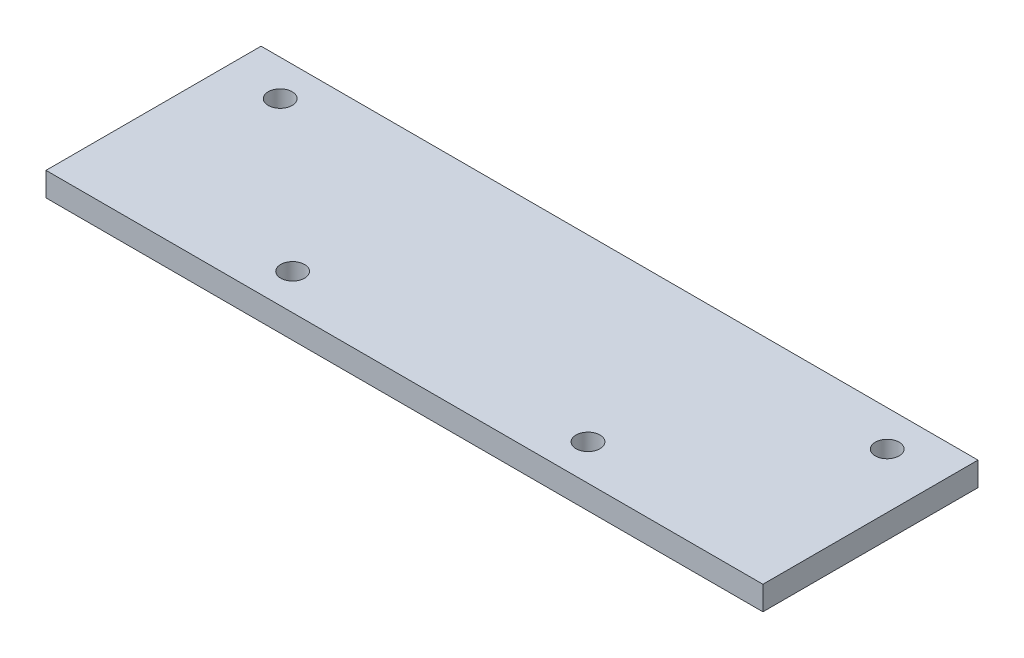
ISO-10303-21;
HEADER;
FILE_DESCRIPTION(('STEP AP214'),'2;1');
FILE_NAME('part.step','',(''),(''),'','','');
FILE_SCHEMA(('AUTOMOTIVE_DESIGN { 1 0 10303 214 1 1 1 1 }'));
ENDSEC;
DATA;
#1=APPLICATION_CONTEXT('core data for automotive mechanical design processes');
#2=APPLICATION_PROTOCOL_DEFINITION('international standard','automotive_design',2000,#1);
#3=PRODUCT_CONTEXT('',#1,'mechanical');
#4=PRODUCT('Part','Part','',(#3));
#5=PRODUCT_RELATED_PRODUCT_CATEGORY('part','',(#4));
#6=PRODUCT_DEFINITION_FORMATION('','',#4);
#7=PRODUCT_DEFINITION_CONTEXT('part definition',#1,'design');
#8=PRODUCT_DEFINITION('design','',#6,#7);
#9=PRODUCT_DEFINITION_SHAPE('','',#8);
#10=(LENGTH_UNIT() NAMED_UNIT(*) SI_UNIT(.MILLI.,.METRE.));
#11=(NAMED_UNIT(*) PLANE_ANGLE_UNIT() SI_UNIT($,.RADIAN.));
#12=(NAMED_UNIT(*) SI_UNIT($,.STERADIAN.) SOLID_ANGLE_UNIT());
#13=UNCERTAINTY_MEASURE_WITH_UNIT(LENGTH_MEASURE(1.E-05),#10,'distance_accuracy_value','');
#14=(GEOMETRIC_REPRESENTATION_CONTEXT(3) GLOBAL_UNCERTAINTY_ASSIGNED_CONTEXT((#13)) GLOBAL_UNIT_ASSIGNED_CONTEXT((#10,
#11,#12)) REPRESENTATION_CONTEXT('',''));
#15=CARTESIAN_POINT('',(0.,0.,0.));
#16=DIRECTION('',(0.,0.,1.));
#17=DIRECTION('',(1.,0.,0.));
#18=AXIS2_PLACEMENT_3D('',#15,#16,#17);
#19=CARTESIAN_POINT('',(95.25,6.35,-28.575));
#20=DIRECTION('',(-1.,0.,0.));
#21=DIRECTION('',(0.,0.,1.));
#22=AXIS2_PLACEMENT_3D('',#19,#20,#21);
#23=PLANE('',#22);
#24=DIRECTION('',(0.,0.,-1.));
#25=VECTOR('',#24,1.);
#26=CARTESIAN_POINT('',(95.25,0.,-28.575));
#27=LINE('',#26,#25);
#28=CARTESIAN_POINT('',(95.25,0.,28.575));
#29=VERTEX_POINT('',#28);
#30=CARTESIAN_POINT('',(95.25,0.,-28.575));
#31=VERTEX_POINT('',#30);
#32=EDGE_CURVE('E98',#29,#31,#27,.T.);
#33=ORIENTED_EDGE('',*,*,#32,.T.);
#34=DIRECTION('',(0.,-1.,0.));
#35=VECTOR('',#34,1.);
#36=CARTESIAN_POINT('',(95.25,6.35,-28.575));
#37=LINE('',#36,#35);
#38=CARTESIAN_POINT('',(95.25,6.35,-28.575));
#39=VERTEX_POINT('',#38);
#40=EDGE_CURVE('E11',#39,#31,#37,.T.);
#41=ORIENTED_EDGE('',*,*,#40,.F.);
#42=DIRECTION('',(0.,0.,-1.));
#43=VECTOR('',#42,1.);
#44=CARTESIAN_POINT('',(95.25,6.35,-28.575));
#45=LINE('',#44,#43);
#46=CARTESIAN_POINT('',(95.25,6.35,28.575));
#47=VERTEX_POINT('',#46);
#48=EDGE_CURVE('E86',#47,#39,#45,.T.);
#49=ORIENTED_EDGE('',*,*,#48,.F.);
#50=DIRECTION('',(0.,-1.,0.));
#51=VECTOR('',#50,1.);
#52=CARTESIAN_POINT('',(95.25,6.35,28.575));
#53=LINE('',#52,#51);
#54=EDGE_CURVE('E94',#47,#29,#53,.T.);
#55=ORIENTED_EDGE('',*,*,#54,.T.);
#56=EDGE_LOOP('',(#33,#41,#49,#55));
#57=FACE_BOUND('',#56,.T.);
#58=ADVANCED_FACE('F35',(#57),#23,.F.);
#59=CARTESIAN_POINT('',(-95.25,6.35,-28.575));
#60=DIRECTION('',(0.,0.,1.));
#61=DIRECTION('',(1.,0.,0.));
#62=AXIS2_PLACEMENT_3D('',#59,#60,#61);
#63=PLANE('',#62);
#64=DIRECTION('',(-1.,0.,0.));
#65=VECTOR('',#64,1.);
#66=CARTESIAN_POINT('',(-95.25,0.,-28.575));
#67=LINE('',#66,#65);
#68=CARTESIAN_POINT('',(-95.25,0.,-28.575));
#69=VERTEX_POINT('',#68);
#70=EDGE_CURVE('E90',#31,#69,#67,.T.);
#71=ORIENTED_EDGE('',*,*,#70,.T.);
#72=DIRECTION('',(0.,-1.,0.));
#73=VECTOR('',#72,1.);
#74=CARTESIAN_POINT('',(-95.25,6.35,-28.575));
#75=LINE('',#74,#73);
#76=CARTESIAN_POINT('',(-95.25,6.35,-28.575));
#77=VERTEX_POINT('',#76);
#78=EDGE_CURVE('E43',#77,#69,#75,.T.);
#79=ORIENTED_EDGE('',*,*,#78,.F.);
#80=DIRECTION('',(-1.,0.,0.));
#81=VECTOR('',#80,1.);
#82=CARTESIAN_POINT('',(-95.25,6.35,-28.575));
#83=LINE('',#82,#81);
#84=EDGE_CURVE('E81',#39,#77,#83,.T.);
#85=ORIENTED_EDGE('',*,*,#84,.F.);
#86=ORIENTED_EDGE('',*,*,#40,.T.);
#87=EDGE_LOOP('',(#71,#79,#85,#86));
#88=FACE_BOUND('',#87,.T.);
#89=ADVANCED_FACE('F89',(#88),#63,.F.);
#90=CARTESIAN_POINT('',(-95.25,6.35,-28.575));
#91=DIRECTION('',(1.,0.,0.));
#92=DIRECTION('',(0.,0.,-1.));
#93=AXIS2_PLACEMENT_3D('',#90,#91,#92);
#94=PLANE('',#93);
#95=DIRECTION('',(0.,0.,1.));
#96=VECTOR('',#95,1.);
#97=CARTESIAN_POINT('',(-95.25,0.,-28.575));
#98=LINE('',#97,#96);
#99=CARTESIAN_POINT('',(-95.25,0.,28.575));
#100=VERTEX_POINT('',#99);
#101=EDGE_CURVE('E68',#69,#100,#98,.T.);
#102=ORIENTED_EDGE('',*,*,#101,.T.);
#103=DIRECTION('',(0.,-1.,0.));
#104=VECTOR('',#103,1.);
#105=CARTESIAN_POINT('',(-95.25,6.35,28.575));
#106=LINE('',#105,#104);
#107=CARTESIAN_POINT('',(-95.25,6.35,28.575));
#108=VERTEX_POINT('',#107);
#109=EDGE_CURVE('E91',#108,#100,#106,.T.);
#110=ORIENTED_EDGE('',*,*,#109,.F.);
#111=DIRECTION('',(0.,0.,1.));
#112=VECTOR('',#111,1.);
#113=CARTESIAN_POINT('',(-95.25,6.35,-28.575));
#114=LINE('',#113,#112);
#115=EDGE_CURVE('E84',#77,#108,#114,.T.);
#116=ORIENTED_EDGE('',*,*,#115,.F.);
#117=ORIENTED_EDGE('',*,*,#78,.T.);
#118=EDGE_LOOP('',(#102,#110,#116,#117));
#119=FACE_BOUND('',#118,.T.);
#120=ADVANCED_FACE('F92',(#119),#94,.F.);
#121=CARTESIAN_POINT('',(-95.25,6.35,28.575));
#122=DIRECTION('',(0.,0.,-1.));
#123=DIRECTION('',(-1.,0.,0.));
#124=AXIS2_PLACEMENT_3D('',#121,#122,#123);
#125=PLANE('',#124);
#126=DIRECTION('',(1.,0.,0.));
#127=VECTOR('',#126,1.);
#128=CARTESIAN_POINT('',(-95.25,0.,28.575));
#129=LINE('',#128,#127);
#130=EDGE_CURVE('E74',#100,#29,#129,.T.);
#131=ORIENTED_EDGE('',*,*,#130,.T.);
#132=ORIENTED_EDGE('',*,*,#54,.F.);
#133=DIRECTION('',(1.,0.,0.));
#134=VECTOR('',#133,1.);
#135=CARTESIAN_POINT('',(-95.25,6.35,28.575));
#136=LINE('',#135,#134);
#137=EDGE_CURVE('E51',#108,#47,#136,.T.);
#138=ORIENTED_EDGE('',*,*,#137,.F.);
#139=ORIENTED_EDGE('',*,*,#109,.T.);
#140=EDGE_LOOP('',(#131,#132,#138,#139));
#141=FACE_BOUND('',#140,.T.);
#142=ADVANCED_FACE('F106',(#141),#125,.F.);
#143=CARTESIAN_POINT('',(0.,6.35,0.));
#144=DIRECTION('',(0.,1.,0.));
#145=DIRECTION('',(0.,0.,1.));
#146=AXIS2_PLACEMENT_3D('',#143,#144,#145);
#147=PLANE('',#146);
#148=CARTESIAN_POINT('',(80.6450000000001,6.35,-19.05));
#149=DIRECTION('',(0.,1.,0.));
#150=DIRECTION('',(0.,0.,-1.));
#151=AXIS2_PLACEMENT_3D('',#148,#149,#150);
#152=CIRCLE('',#151,3.175);
#153=CARTESIAN_POINT('',(80.6450000000001,6.35,-22.225));
#154=VERTEX_POINT('',#153);
#155=EDGE_CURVE('E116',#154,#154,#152,.T.);
#156=ORIENTED_EDGE('',*,*,#155,.F.);
#157=EDGE_LOOP('',(#156));
#158=FACE_BOUND('',#157,.T.);
#159=CARTESIAN_POINT('',(39.243,6.35,19.05));
#160=DIRECTION('',(0.,1.,0.));
#161=DIRECTION('',(0.,0.,-1.));
#162=AXIS2_PLACEMENT_3D('',#159,#160,#161);
#163=CIRCLE('',#162,3.175);
#164=CARTESIAN_POINT('',(39.243,6.35,15.875));
#165=VERTEX_POINT('',#164);
#166=EDGE_CURVE('E127',#165,#165,#163,.T.);
#167=ORIENTED_EDGE('',*,*,#166,.F.);
#168=EDGE_LOOP('',(#167));
#169=FACE_BOUND('',#168,.T.);
#170=CARTESIAN_POINT('',(-80.6450000000001,6.35,-19.05));
#171=DIRECTION('',(0.,-1.,0.));
#172=DIRECTION('',(0.,0.,-1.));
#173=AXIS2_PLACEMENT_3D('',#170,#171,#172);
#174=CIRCLE('',#173,3.175);
#175=CARTESIAN_POINT('',(-80.6450000000001,6.35,-22.225));
#176=VERTEX_POINT('',#175);
#177=EDGE_CURVE('E101',#176,#176,#174,.T.);
#178=ORIENTED_EDGE('',*,*,#177,.T.);
#179=EDGE_LOOP('',(#178));
#180=FACE_BOUND('',#179,.T.);
#181=CARTESIAN_POINT('',(-39.243,6.35,19.05));
#182=DIRECTION('',(0.,-1.,0.));
#183=DIRECTION('',(0.,0.,-1.));
#184=AXIS2_PLACEMENT_3D('',#181,#182,#183);
#185=CIRCLE('',#184,3.175);
#186=CARTESIAN_POINT('',(-39.243,6.35,15.875));
#187=VERTEX_POINT('',#186);
#188=EDGE_CURVE('E115',#187,#187,#185,.T.);
#189=ORIENTED_EDGE('',*,*,#188,.T.);
#190=EDGE_LOOP('',(#189));
#191=FACE_BOUND('',#190,.T.);
#192=ORIENTED_EDGE('',*,*,#48,.T.);
#193=ORIENTED_EDGE('',*,*,#84,.T.);
#194=ORIENTED_EDGE('',*,*,#115,.T.);
#195=ORIENTED_EDGE('',*,*,#137,.T.);
#196=EDGE_LOOP('',(#192,#193,#194,#195));
#197=FACE_BOUND('',#196,.T.);
#198=ADVANCED_FACE('F82',(#158,#169,#180,#191,#197),#147,.T.);
#199=CARTESIAN_POINT('',(0.,0.,0.));
#200=DIRECTION('',(0.,1.,0.));
#201=DIRECTION('',(0.,0.,1.));
#202=AXIS2_PLACEMENT_3D('',#199,#200,#201);
#203=PLANE('',#202);
#204=CARTESIAN_POINT('',(80.6450000000001,0.,-19.05));
#205=DIRECTION('',(0.,1.,0.));
#206=DIRECTION('',(0.,0.,-1.));
#207=AXIS2_PLACEMENT_3D('',#204,#205,#206);
#208=CIRCLE('',#207,3.175);
#209=CARTESIAN_POINT('',(80.6450000000001,0.,-22.225));
#210=VERTEX_POINT('',#209);
#211=EDGE_CURVE('E130',#210,#210,#208,.T.);
#212=ORIENTED_EDGE('',*,*,#211,.T.);
#213=EDGE_LOOP('',(#212));
#214=FACE_BOUND('',#213,.T.);
#215=CARTESIAN_POINT('',(39.243,0.,19.05));
#216=DIRECTION('',(0.,1.,0.));
#217=DIRECTION('',(0.,0.,-1.));
#218=AXIS2_PLACEMENT_3D('',#215,#216,#217);
#219=CIRCLE('',#218,3.175);
#220=CARTESIAN_POINT('',(39.243,0.,15.875));
#221=VERTEX_POINT('',#220);
#222=EDGE_CURVE('E124',#221,#221,#219,.T.);
#223=ORIENTED_EDGE('',*,*,#222,.T.);
#224=EDGE_LOOP('',(#223));
#225=FACE_BOUND('',#224,.T.);
#226=CARTESIAN_POINT('',(-80.6450000000001,0.,-19.05));
#227=DIRECTION('',(0.,-1.,0.));
#228=DIRECTION('',(0.,0.,-1.));
#229=AXIS2_PLACEMENT_3D('',#226,#227,#228);
#230=CIRCLE('',#229,3.175);
#231=CARTESIAN_POINT('',(-80.6450000000001,0.,-22.225));
#232=VERTEX_POINT('',#231);
#233=EDGE_CURVE('E119',#232,#232,#230,.T.);
#234=ORIENTED_EDGE('',*,*,#233,.F.);
#235=EDGE_LOOP('',(#234));
#236=FACE_BOUND('',#235,.T.);
#237=CARTESIAN_POINT('',(-39.243,0.,19.05));
#238=DIRECTION('',(0.,-1.,0.));
#239=DIRECTION('',(0.,0.,-1.));
#240=AXIS2_PLACEMENT_3D('',#237,#238,#239);
#241=CIRCLE('',#240,3.175);
#242=CARTESIAN_POINT('',(-39.243,0.,15.875));
#243=VERTEX_POINT('',#242);
#244=EDGE_CURVE('E112',#243,#243,#241,.T.);
#245=ORIENTED_EDGE('',*,*,#244,.F.);
#246=EDGE_LOOP('',(#245));
#247=FACE_BOUND('',#246,.T.);
#248=ORIENTED_EDGE('',*,*,#32,.F.);
#249=ORIENTED_EDGE('',*,*,#130,.F.);
#250=ORIENTED_EDGE('',*,*,#101,.F.);
#251=ORIENTED_EDGE('',*,*,#70,.F.);
#252=EDGE_LOOP('',(#248,#249,#250,#251));
#253=FACE_BOUND('',#252,.T.);
#254=ADVANCED_FACE('F109',(#214,#225,#236,#247,#253),#203,.F.);
#255=CARTESIAN_POINT('',(-39.243,6.35,19.05));
#256=DIRECTION('',(0.,-1.,0.));
#257=DIRECTION('',(0.,0.,-1.));
#258=AXIS2_PLACEMENT_3D('',#255,#256,#257);
#259=CYLINDRICAL_SURFACE('',#258,3.175);
#260=ORIENTED_EDGE('',*,*,#188,.F.);
#261=EDGE_LOOP('',(#260));
#262=FACE_BOUND('',#261,.T.);
#263=ORIENTED_EDGE('',*,*,#244,.T.);
#264=EDGE_LOOP('',(#263));
#265=FACE_BOUND('',#264,.T.);
#266=ADVANCED_FACE('F148',(#262,#265),#259,.F.);
#267=CARTESIAN_POINT('',(-80.6450000000001,6.35,-19.05));
#268=DIRECTION('',(0.,-1.,0.));
#269=DIRECTION('',(0.,0.,-1.));
#270=AXIS2_PLACEMENT_3D('',#267,#268,#269);
#271=CYLINDRICAL_SURFACE('',#270,3.175);
#272=ORIENTED_EDGE('',*,*,#177,.F.);
#273=EDGE_LOOP('',(#272));
#274=FACE_BOUND('',#273,.T.);
#275=ORIENTED_EDGE('',*,*,#233,.T.);
#276=EDGE_LOOP('',(#275));
#277=FACE_BOUND('',#276,.T.);
#278=ADVANCED_FACE('F151',(#274,#277),#271,.F.);
#279=CARTESIAN_POINT('',(39.243,6.35,19.05));
#280=DIRECTION('',(0.,-1.,0.));
#281=DIRECTION('',(0.,0.,-1.));
#282=AXIS2_PLACEMENT_3D('',#279,#280,#281);
#283=CYLINDRICAL_SURFACE('',#282,3.175);
#284=ORIENTED_EDGE('',*,*,#166,.T.);
#285=EDGE_LOOP('',(#284));
#286=FACE_BOUND('',#285,.T.);
#287=ORIENTED_EDGE('',*,*,#222,.F.);
#288=EDGE_LOOP('',(#287));
#289=FACE_BOUND('',#288,.T.);
#290=ADVANCED_FACE('F194',(#286,#289),#283,.F.);
#291=CARTESIAN_POINT('',(80.6450000000001,6.35,-19.05));
#292=DIRECTION('',(0.,-1.,0.));
#293=DIRECTION('',(0.,0.,-1.));
#294=AXIS2_PLACEMENT_3D('',#291,#292,#293);
#295=CYLINDRICAL_SURFACE('',#294,3.175);
#296=ORIENTED_EDGE('',*,*,#155,.T.);
#297=EDGE_LOOP('',(#296));
#298=FACE_BOUND('',#297,.T.);
#299=ORIENTED_EDGE('',*,*,#211,.F.);
#300=EDGE_LOOP('',(#299));
#301=FACE_BOUND('',#300,.T.);
#302=ADVANCED_FACE('F136',(#298,#301),#295,.F.);
#303=CLOSED_SHELL('',(#58,#89,#120,#142,#198,#254,#266,#278,#290,#302));
#304=MANIFOLD_SOLID_BREP('B2',#303);
#305=ADVANCED_BREP_SHAPE_REPRESENTATION('',(#18,#304),#14);
#306=SHAPE_DEFINITION_REPRESENTATION(#9,#305);
ENDSEC;
END-ISO-10303-21;
